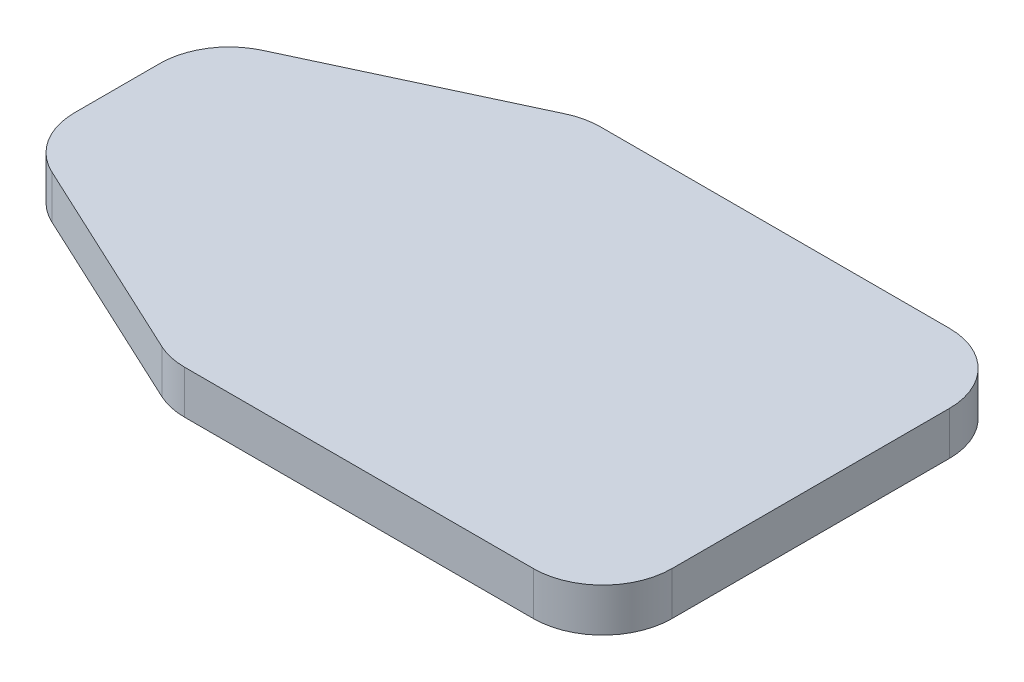
ISO-10303-21;
HEADER;
FILE_DESCRIPTION(('STEP AP214'),'2;1');
FILE_NAME('part.step','',(''),(''),'','','');
FILE_SCHEMA(('AUTOMOTIVE_DESIGN { 1 0 10303 214 1 1 1 1 }'));
ENDSEC;
DATA;
#1=APPLICATION_CONTEXT('core data for automotive mechanical design processes');
#2=APPLICATION_PROTOCOL_DEFINITION('international standard','automotive_design',2000,#1);
#3=PRODUCT_CONTEXT('',#1,'mechanical');
#4=PRODUCT('Part','Part','',(#3));
#5=PRODUCT_RELATED_PRODUCT_CATEGORY('part','',(#4));
#6=PRODUCT_DEFINITION_FORMATION('','',#4);
#7=PRODUCT_DEFINITION_CONTEXT('part definition',#1,'design');
#8=PRODUCT_DEFINITION('design','',#6,#7);
#9=PRODUCT_DEFINITION_SHAPE('','',#8);
#10=(LENGTH_UNIT() NAMED_UNIT(*) SI_UNIT(.MILLI.,.METRE.));
#11=(NAMED_UNIT(*) PLANE_ANGLE_UNIT() SI_UNIT($,.RADIAN.));
#12=(NAMED_UNIT(*) SI_UNIT($,.STERADIAN.) SOLID_ANGLE_UNIT());
#13=UNCERTAINTY_MEASURE_WITH_UNIT(LENGTH_MEASURE(1.E-05),#10,'distance_accuracy_value','');
#14=(GEOMETRIC_REPRESENTATION_CONTEXT(3) GLOBAL_UNCERTAINTY_ASSIGNED_CONTEXT((#13)) GLOBAL_UNIT_ASSIGNED_CONTEXT((#10,
#11,#12)) REPRESENTATION_CONTEXT('',''));
#15=CARTESIAN_POINT('',(0.,0.,0.));
#16=DIRECTION('',(0.,0.,1.));
#17=DIRECTION('',(1.,0.,0.));
#18=AXIS2_PLACEMENT_3D('',#15,#16,#17);
#19=CARTESIAN_POINT('',(-25.4,3.175,0.));
#20=DIRECTION('',(1.,0.,0.));
#21=DIRECTION('',(0.,0.,1.));
#22=AXIS2_PLACEMENT_3D('',#19,#20,#21);
#23=PLANE('',#22);
#24=DIRECTION('',(0.,0.,-1.));
#25=VECTOR('',#24,1.);
#26=CARTESIAN_POINT('',(-25.4,3.175,0.));
#27=LINE('',#26,#25);
#28=CARTESIAN_POINT('',(-25.4,3.175,3.11473583901241));
#29=VERTEX_POINT('',#28);
#30=CARTESIAN_POINT('',(-25.4,3.175,-3.1147358390124));
#31=VERTEX_POINT('',#30);
#32=EDGE_CURVE('E153',#29,#31,#27,.T.);
#33=ORIENTED_EDGE('',*,*,#32,.T.);
#34=DIRECTION('',(0.,-1.,0.));
#35=VECTOR('',#34,1.);
#36=CARTESIAN_POINT('',(-25.4,3.175,-3.1147358390124));
#37=LINE('',#36,#35);
#38=CARTESIAN_POINT('',(-25.4,0.,-3.1147358390124));
#39=VERTEX_POINT('',#38);
#40=EDGE_CURVE('E190',#39,#31,#37,.F.);
#41=ORIENTED_EDGE('',*,*,#40,.F.);
#42=DIRECTION('',(0.,0.,-1.));
#43=VECTOR('',#42,1.);
#44=CARTESIAN_POINT('',(-25.4,0.,0.));
#45=LINE('',#44,#43);
#46=CARTESIAN_POINT('',(-25.4,0.,3.11473583901241));
#47=VERTEX_POINT('',#46);
#48=EDGE_CURVE('E224',#47,#39,#45,.T.);
#49=ORIENTED_EDGE('',*,*,#48,.F.);
#50=DIRECTION('',(0.,-1.,0.));
#51=VECTOR('',#50,1.);
#52=CARTESIAN_POINT('',(-25.4,0.,3.11473583901241));
#53=LINE('',#52,#51);
#54=EDGE_CURVE('E139',#29,#47,#53,.T.);
#55=ORIENTED_EDGE('',*,*,#54,.F.);
#56=EDGE_LOOP('',(#33,#41,#49,#55));
#57=FACE_BOUND('',#56,.T.);
#58=ADVANCED_FACE('F41',(#57),#23,.F.);
#59=CARTESIAN_POINT('',(-6.9757299270073,3.175,-14.9479927007299));
#60=DIRECTION('',(0.422885465331124,0.,0.906183139995265));
#61=DIRECTION('',(-0.906183139995265,0.,0.422885465331124));
#62=AXIS2_PLACEMENT_3D('',#59,#60,#61);
#63=PLANE('',#62);
#64=DIRECTION('',(0.906183139995265,0.,-0.422885465331124));
#65=VECTOR('',#64,1.);
#66=CARTESIAN_POINT('',(-6.9757299270073,3.175,-14.9479927007299));
#67=LINE('',#66,#65);
#68=CARTESIAN_POINT('',(-22.4682581638821,3.175,-7.71814619018835));
#69=VERTEX_POINT('',#68);
#70=CARTESIAN_POINT('',(-7.37126353319441,3.175,-14.7634103511759));
#71=VERTEX_POINT('',#70);
#72=EDGE_CURVE('E212',#69,#71,#67,.T.);
#73=ORIENTED_EDGE('',*,*,#72,.T.);
#74=DIRECTION('',(0.,-1.,0.));
#75=VECTOR('',#74,1.);
#76=CARTESIAN_POINT('',(-7.37126353319441,3.175,-14.7634103511759));
#77=LINE('',#76,#75);
#78=CARTESIAN_POINT('',(-7.37126353319441,0.,-14.7634103511759));
#79=VERTEX_POINT('',#78);
#80=EDGE_CURVE('E49',#79,#71,#77,.F.);
#81=ORIENTED_EDGE('',*,*,#80,.F.);
#82=DIRECTION('',(0.906183139995265,0.,-0.422885465331124));
#83=VECTOR('',#82,1.);
#84=CARTESIAN_POINT('',(-6.9757299270073,0.,-14.9479927007299));
#85=LINE('',#84,#83);
#86=CARTESIAN_POINT('',(-22.4682581638821,0.,-7.71814619018835));
#87=VERTEX_POINT('',#86);
#88=EDGE_CURVE('E226',#87,#79,#85,.T.);
#89=ORIENTED_EDGE('',*,*,#88,.F.);
#90=DIRECTION('',(0.,-1.,0.));
#91=VECTOR('',#90,1.);
#92=CARTESIAN_POINT('',(-22.4682581638821,3.175,-7.71814619018835));
#93=LINE('',#92,#91);
#94=EDGE_CURVE('E11',#69,#87,#93,.T.);
#95=ORIENTED_EDGE('',*,*,#94,.F.);
#96=EDGE_LOOP('',(#73,#81,#89,#95));
#97=FACE_BOUND('',#96,.T.);
#98=ADVANCED_FACE('F213',(#97),#63,.F.);
#99=CARTESIAN_POINT('',(0.,3.175,-15.24));
#100=DIRECTION('',(0.,0.,1.));
#101=DIRECTION('',(-1.,0.,0.));
#102=AXIS2_PLACEMENT_3D('',#99,#100,#101);
#103=PLANE('',#102);
#104=DIRECTION('',(1.,0.,0.));
#105=VECTOR('',#104,1.);
#106=CARTESIAN_POINT('',(0.,0.,-15.24));
#107=LINE('',#106,#105);
#108=CARTESIAN_POINT('',(-5.2230053693123,0.,-15.24));
#109=VERTEX_POINT('',#108);
#110=CARTESIAN_POINT('',(20.32,0.,-15.24));
#111=VERTEX_POINT('',#110);
#112=EDGE_CURVE('E228',#109,#111,#107,.T.);
#113=ORIENTED_EDGE('',*,*,#112,.F.);
#114=DIRECTION('',(0.,-1.,0.));
#115=VECTOR('',#114,1.);
#116=CARTESIAN_POINT('',(-5.2230053693123,3.175,-15.24));
#117=LINE('',#116,#115);
#118=CARTESIAN_POINT('',(-5.2230053693123,3.175,-15.24));
#119=VERTEX_POINT('',#118);
#120=EDGE_CURVE('E198',#119,#109,#117,.T.);
#121=ORIENTED_EDGE('',*,*,#120,.F.);
#122=DIRECTION('',(1.,0.,0.));
#123=VECTOR('',#122,1.);
#124=CARTESIAN_POINT('',(0.,3.175,-15.24));
#125=LINE('',#124,#123);
#126=CARTESIAN_POINT('',(20.32,3.175,-15.24));
#127=VERTEX_POINT('',#126);
#128=EDGE_CURVE('E214',#119,#127,#125,.T.);
#129=ORIENTED_EDGE('',*,*,#128,.T.);
#130=DIRECTION('',(0.,-1.,0.));
#131=VECTOR('',#130,1.);
#132=CARTESIAN_POINT('',(20.32,3.175,-15.24));
#133=LINE('',#132,#131);
#134=EDGE_CURVE('E201',#111,#127,#133,.F.);
#135=ORIENTED_EDGE('',*,*,#134,.F.);
#136=EDGE_LOOP('',(#113,#121,#129,#135));
#137=FACE_BOUND('',#136,.T.);
#138=ADVANCED_FACE('F262',(#137),#103,.F.);
#139=CARTESIAN_POINT('',(25.4,3.175,0.));
#140=DIRECTION('',(1.,0.,0.));
#141=DIRECTION('',(0.,0.,1.));
#142=AXIS2_PLACEMENT_3D('',#139,#140,#141);
#143=PLANE('',#142);
#144=DIRECTION('',(0.,0.,-1.));
#145=VECTOR('',#144,1.);
#146=CARTESIAN_POINT('',(25.4,3.175,0.));
#147=LINE('',#146,#145);
#148=CARTESIAN_POINT('',(25.4,3.175,10.16));
#149=VERTEX_POINT('',#148);
#150=CARTESIAN_POINT('',(25.4,3.175,-10.16));
#151=VERTEX_POINT('',#150);
#152=EDGE_CURVE('E217',#149,#151,#147,.T.);
#153=ORIENTED_EDGE('',*,*,#152,.F.);
#154=DIRECTION('',(0.,-1.,0.));
#155=VECTOR('',#154,1.);
#156=CARTESIAN_POINT('',(25.4,3.175,10.16));
#157=LINE('',#156,#155);
#158=CARTESIAN_POINT('',(25.4,0.,10.16));
#159=VERTEX_POINT('',#158);
#160=EDGE_CURVE('E194',#159,#149,#157,.F.);
#161=ORIENTED_EDGE('',*,*,#160,.F.);
#162=DIRECTION('',(0.,0.,-1.));
#163=VECTOR('',#162,1.);
#164=CARTESIAN_POINT('',(25.4,0.,0.));
#165=LINE('',#164,#163);
#166=CARTESIAN_POINT('',(25.4,0.,-10.16));
#167=VERTEX_POINT('',#166);
#168=EDGE_CURVE('E231',#159,#167,#165,.T.);
#169=ORIENTED_EDGE('',*,*,#168,.T.);
#170=DIRECTION('',(0.,-1.,0.));
#171=VECTOR('',#170,1.);
#172=CARTESIAN_POINT('',(25.4,0.,-10.16));
#173=LINE('',#172,#171);
#174=EDGE_CURVE('E196',#151,#167,#173,.T.);
#175=ORIENTED_EDGE('',*,*,#174,.F.);
#176=EDGE_LOOP('',(#153,#161,#169,#175));
#177=FACE_BOUND('',#176,.T.);
#178=ADVANCED_FACE('F267',(#177),#143,.T.);
#179=CARTESIAN_POINT('',(0.,3.175,15.24));
#180=DIRECTION('',(0.,0.,1.));
#181=DIRECTION('',(-1.,0.,0.));
#182=AXIS2_PLACEMENT_3D('',#179,#180,#181);
#183=PLANE('',#182);
#184=DIRECTION('',(1.,0.,0.));
#185=VECTOR('',#184,1.);
#186=CARTESIAN_POINT('',(0.,0.,15.24));
#187=LINE('',#186,#185);
#188=CARTESIAN_POINT('',(-5.2230053693123,0.,15.24));
#189=VERTEX_POINT('',#188);
#190=CARTESIAN_POINT('',(20.32,0.,15.24));
#191=VERTEX_POINT('',#190);
#192=EDGE_CURVE('E154',#189,#191,#187,.T.);
#193=ORIENTED_EDGE('',*,*,#192,.T.);
#194=DIRECTION('',(0.,-1.,0.));
#195=VECTOR('',#194,1.);
#196=CARTESIAN_POINT('',(20.32,3.175,15.24));
#197=LINE('',#196,#195);
#198=CARTESIAN_POINT('',(20.32,3.175,15.24));
#199=VERTEX_POINT('',#198);
#200=EDGE_CURVE('E174',#199,#191,#197,.T.);
#201=ORIENTED_EDGE('',*,*,#200,.F.);
#202=DIRECTION('',(1.,0.,0.));
#203=VECTOR('',#202,1.);
#204=CARTESIAN_POINT('',(0.,3.175,15.24));
#205=LINE('',#204,#203);
#206=CARTESIAN_POINT('',(-5.2230053693123,3.175,15.24));
#207=VERTEX_POINT('',#206);
#208=EDGE_CURVE('E163',#207,#199,#205,.T.);
#209=ORIENTED_EDGE('',*,*,#208,.F.);
#210=DIRECTION('',(0.,-1.,0.));
#211=VECTOR('',#210,1.);
#212=CARTESIAN_POINT('',(-5.2230053693123,3.175,15.24));
#213=LINE('',#212,#211);
#214=EDGE_CURVE('E177',#189,#207,#213,.F.);
#215=ORIENTED_EDGE('',*,*,#214,.F.);
#216=EDGE_LOOP('',(#193,#201,#209,#215));
#217=FACE_BOUND('',#216,.T.);
#218=ADVANCED_FACE('F237',(#217),#183,.T.);
#219=CARTESIAN_POINT('',(-6.9757299270073,3.175,14.9479927007299));
#220=DIRECTION('',(-0.422885465331124,0.,0.906183139995265));
#221=DIRECTION('',(-0.906183139995265,0.,-0.422885465331124));
#222=AXIS2_PLACEMENT_3D('',#219,#220,#221);
#223=PLANE('',#222);
#224=DIRECTION('',(0.906183139995265,0.,0.422885465331124));
#225=VECTOR('',#224,1.);
#226=CARTESIAN_POINT('',(-6.9757299270073,3.175,14.9479927007299));
#227=LINE('',#226,#225);
#228=CARTESIAN_POINT('',(-22.4682581638821,3.175,7.71814619018835));
#229=VERTEX_POINT('',#228);
#230=CARTESIAN_POINT('',(-7.37126353319441,3.175,14.7634103511759));
#231=VERTEX_POINT('',#230);
#232=EDGE_CURVE('E158',#229,#231,#227,.T.);
#233=ORIENTED_EDGE('',*,*,#232,.F.);
#234=DIRECTION('',(0.,-1.,0.));
#235=VECTOR('',#234,1.);
#236=CARTESIAN_POINT('',(-22.4682581638821,3.175,7.71814619018835));
#237=LINE('',#236,#235);
#238=CARTESIAN_POINT('',(-22.4682581638821,0.,7.71814619018835));
#239=VERTEX_POINT('',#238);
#240=EDGE_CURVE('E136',#239,#229,#237,.F.);
#241=ORIENTED_EDGE('',*,*,#240,.F.);
#242=DIRECTION('',(0.906183139995265,0.,0.422885465331124));
#243=VECTOR('',#242,1.);
#244=CARTESIAN_POINT('',(-6.9757299270073,0.,14.9479927007299));
#245=LINE('',#244,#243);
#246=CARTESIAN_POINT('',(-7.37126353319441,0.,14.7634103511759));
#247=VERTEX_POINT('',#246);
#248=EDGE_CURVE('E147',#239,#247,#245,.T.);
#249=ORIENTED_EDGE('',*,*,#248,.T.);
#250=DIRECTION('',(0.,-1.,0.));
#251=VECTOR('',#250,1.);
#252=CARTESIAN_POINT('',(-7.37126353319441,3.175,14.7634103511759));
#253=LINE('',#252,#251);
#254=EDGE_CURVE('E159',#231,#247,#253,.T.);
#255=ORIENTED_EDGE('',*,*,#254,.F.);
#256=EDGE_LOOP('',(#233,#241,#249,#255));
#257=FACE_BOUND('',#256,.T.);
#258=ADVANCED_FACE('F156',(#257),#223,.T.);
#259=CARTESIAN_POINT('',(0.,3.175,0.));
#260=DIRECTION('',(0.,1.,0.));
#261=DIRECTION('',(0.,0.,-1.));
#262=AXIS2_PLACEMENT_3D('',#259,#260,#261);
#263=PLANE('',#262);
#264=ORIENTED_EDGE('',*,*,#208,.T.);
#265=CARTESIAN_POINT('',(20.32,3.175,10.16));
#266=DIRECTION('',(0.,-1.,0.));
#267=DIRECTION('',(0.,0.,-1.));
#268=AXIS2_PLACEMENT_3D('',#265,#266,#267);
#269=CIRCLE('',#268,5.08);
#270=EDGE_CURVE('E64',#149,#199,#269,.T.);
#271=ORIENTED_EDGE('',*,*,#270,.F.);
#272=ORIENTED_EDGE('',*,*,#152,.T.);
#273=CARTESIAN_POINT('',(20.32,3.175,-10.16));
#274=DIRECTION('',(0.,-1.,0.));
#275=DIRECTION('',(0.,0.,-1.));
#276=AXIS2_PLACEMENT_3D('',#273,#274,#275);
#277=CIRCLE('',#276,5.08);
#278=EDGE_CURVE('E56',#127,#151,#277,.T.);
#279=ORIENTED_EDGE('',*,*,#278,.F.);
#280=ORIENTED_EDGE('',*,*,#128,.F.);
#281=CARTESIAN_POINT('',(-5.2230053693123,3.175,-10.16));
#282=DIRECTION('',(0.,-1.,0.));
#283=DIRECTION('',(0.,0.,-1.));
#284=AXIS2_PLACEMENT_3D('',#281,#282,#283);
#285=CIRCLE('',#284,5.08);
#286=EDGE_CURVE('E180',#71,#119,#285,.T.);
#287=ORIENTED_EDGE('',*,*,#286,.F.);
#288=ORIENTED_EDGE('',*,*,#72,.F.);
#289=CARTESIAN_POINT('',(-20.32,3.175,-3.1147358390124));
#290=DIRECTION('',(0.,-1.,0.));
#291=DIRECTION('',(0.,0.,-1.));
#292=AXIS2_PLACEMENT_3D('',#289,#290,#291);
#293=CIRCLE('',#292,5.08);
#294=EDGE_CURVE('E182',#31,#69,#293,.T.);
#295=ORIENTED_EDGE('',*,*,#294,.F.);
#296=ORIENTED_EDGE('',*,*,#32,.F.);
#297=CARTESIAN_POINT('',(-20.32,3.175,3.11473583901241));
#298=DIRECTION('',(0.,-1.,0.));
#299=DIRECTION('',(0.,0.,-1.));
#300=AXIS2_PLACEMENT_3D('',#297,#298,#299);
#301=CIRCLE('',#300,5.08);
#302=EDGE_CURVE('E186',#229,#29,#301,.T.);
#303=ORIENTED_EDGE('',*,*,#302,.F.);
#304=ORIENTED_EDGE('',*,*,#232,.T.);
#305=CARTESIAN_POINT('',(-5.2230053693123,3.175,10.16));
#306=DIRECTION('',(0.,-1.,0.));
#307=DIRECTION('',(0.,0.,-1.));
#308=AXIS2_PLACEMENT_3D('',#305,#306,#307);
#309=CIRCLE('',#308,5.08);
#310=EDGE_CURVE('E188',#207,#231,#309,.T.);
#311=ORIENTED_EDGE('',*,*,#310,.F.);
#312=EDGE_LOOP('',(#264,#271,#272,#279,#280,#287,#288,#295,#296,#303,#304,#311));
#313=FACE_BOUND('',#312,.T.);
#314=ADVANCED_FACE('F244',(#313),#263,.T.);
#315=CARTESIAN_POINT('',(0.,0.,0.));
#316=DIRECTION('',(0.,1.,0.));
#317=DIRECTION('',(0.,0.,-1.));
#318=AXIS2_PLACEMENT_3D('',#315,#316,#317);
#319=PLANE('',#318);
#320=ORIENTED_EDGE('',*,*,#248,.F.);
#321=CARTESIAN_POINT('',(-20.32,0.,3.11473583901241));
#322=DIRECTION('',(0.,-1.,0.));
#323=DIRECTION('',(0.,0.,-1.));
#324=AXIS2_PLACEMENT_3D('',#321,#322,#323);
#325=CIRCLE('',#324,5.08);
#326=EDGE_CURVE('E132',#47,#239,#325,.F.);
#327=ORIENTED_EDGE('',*,*,#326,.F.);
#328=ORIENTED_EDGE('',*,*,#48,.T.);
#329=CARTESIAN_POINT('',(-20.32,0.,-3.1147358390124));
#330=DIRECTION('',(0.,-1.,0.));
#331=DIRECTION('',(0.,0.,-1.));
#332=AXIS2_PLACEMENT_3D('',#329,#330,#331);
#333=CIRCLE('',#332,5.08);
#334=EDGE_CURVE('E168',#87,#39,#333,.F.);
#335=ORIENTED_EDGE('',*,*,#334,.F.);
#336=ORIENTED_EDGE('',*,*,#88,.T.);
#337=CARTESIAN_POINT('',(-5.2230053693123,0.,-10.16));
#338=DIRECTION('',(0.,-1.,0.));
#339=DIRECTION('',(0.,0.,-1.));
#340=AXIS2_PLACEMENT_3D('',#337,#338,#339);
#341=CIRCLE('',#340,5.08);
#342=EDGE_CURVE('E161',#109,#79,#341,.F.);
#343=ORIENTED_EDGE('',*,*,#342,.F.);
#344=ORIENTED_EDGE('',*,*,#112,.T.);
#345=CARTESIAN_POINT('',(20.32,0.,-10.16));
#346=DIRECTION('',(0.,-1.,0.));
#347=DIRECTION('',(0.,0.,-1.));
#348=AXIS2_PLACEMENT_3D('',#345,#346,#347);
#349=CIRCLE('',#348,5.08);
#350=EDGE_CURVE('E144',#167,#111,#349,.F.);
#351=ORIENTED_EDGE('',*,*,#350,.F.);
#352=ORIENTED_EDGE('',*,*,#168,.F.);
#353=CARTESIAN_POINT('',(20.32,0.,10.16));
#354=DIRECTION('',(0.,-1.,0.));
#355=DIRECTION('',(0.,0.,-1.));
#356=AXIS2_PLACEMENT_3D('',#353,#354,#355);
#357=CIRCLE('',#356,5.08);
#358=EDGE_CURVE('E170',#191,#159,#357,.F.);
#359=ORIENTED_EDGE('',*,*,#358,.F.);
#360=ORIENTED_EDGE('',*,*,#192,.F.);
#361=CARTESIAN_POINT('',(-5.2230053693123,0.,10.16));
#362=DIRECTION('',(0.,-1.,0.));
#363=DIRECTION('',(0.,0.,-1.));
#364=AXIS2_PLACEMENT_3D('',#361,#362,#363);
#365=CIRCLE('',#364,5.08);
#366=EDGE_CURVE('E143',#247,#189,#365,.F.);
#367=ORIENTED_EDGE('',*,*,#366,.F.);
#368=EDGE_LOOP('',(#320,#327,#328,#335,#336,#343,#344,#351,#352,#359,#360,#367));
#369=FACE_BOUND('',#368,.T.);
#370=ADVANCED_FACE('F148',(#369),#319,.F.);
#371=CARTESIAN_POINT('',(-5.2230053693123,3.175,10.16));
#372=DIRECTION('',(0.,-1.,0.));
#373=DIRECTION('',(0.,0.,1.));
#374=AXIS2_PLACEMENT_3D('',#371,#372,#373);
#375=CYLINDRICAL_SURFACE('',#374,5.08);
#376=ORIENTED_EDGE('',*,*,#310,.T.);
#377=ORIENTED_EDGE('',*,*,#254,.T.);
#378=ORIENTED_EDGE('',*,*,#366,.T.);
#379=ORIENTED_EDGE('',*,*,#214,.T.);
#380=EDGE_LOOP('',(#376,#377,#378,#379));
#381=FACE_BOUND('',#380,.T.);
#382=ADVANCED_FACE('F246',(#381),#375,.T.);
#383=CARTESIAN_POINT('',(-20.32,3.175,3.11473583901241));
#384=DIRECTION('',(0.,1.,0.));
#385=DIRECTION('',(0.,0.,-1.));
#386=AXIS2_PLACEMENT_3D('',#383,#384,#385);
#387=CYLINDRICAL_SURFACE('',#386,5.08);
#388=ORIENTED_EDGE('',*,*,#302,.T.);
#389=ORIENTED_EDGE('',*,*,#54,.T.);
#390=ORIENTED_EDGE('',*,*,#326,.T.);
#391=ORIENTED_EDGE('',*,*,#240,.T.);
#392=EDGE_LOOP('',(#388,#389,#390,#391));
#393=FACE_BOUND('',#392,.T.);
#394=ADVANCED_FACE('F134',(#393),#387,.T.);
#395=CARTESIAN_POINT('',(20.32,3.175,-10.16));
#396=DIRECTION('',(0.,1.,0.));
#397=DIRECTION('',(0.,0.,-1.));
#398=AXIS2_PLACEMENT_3D('',#395,#396,#397);
#399=CYLINDRICAL_SURFACE('',#398,5.08);
#400=ORIENTED_EDGE('',*,*,#278,.T.);
#401=ORIENTED_EDGE('',*,*,#174,.T.);
#402=ORIENTED_EDGE('',*,*,#350,.T.);
#403=ORIENTED_EDGE('',*,*,#134,.T.);
#404=EDGE_LOOP('',(#400,#401,#402,#403));
#405=FACE_BOUND('',#404,.T.);
#406=ADVANCED_FACE('F253',(#405),#399,.T.);
#407=CARTESIAN_POINT('',(20.32,3.175,10.16));
#408=DIRECTION('',(0.,-1.,0.));
#409=DIRECTION('',(0.,0.,1.));
#410=AXIS2_PLACEMENT_3D('',#407,#408,#409);
#411=CYLINDRICAL_SURFACE('',#410,5.08);
#412=ORIENTED_EDGE('',*,*,#270,.T.);
#413=ORIENTED_EDGE('',*,*,#200,.T.);
#414=ORIENTED_EDGE('',*,*,#358,.T.);
#415=ORIENTED_EDGE('',*,*,#160,.T.);
#416=EDGE_LOOP('',(#412,#413,#414,#415));
#417=FACE_BOUND('',#416,.T.);
#418=ADVANCED_FACE('F242',(#417),#411,.T.);
#419=CARTESIAN_POINT('',(-20.32,3.175,-3.1147358390124));
#420=DIRECTION('',(0.,-1.,0.));
#421=DIRECTION('',(0.,0.,1.));
#422=AXIS2_PLACEMENT_3D('',#419,#420,#421);
#423=CYLINDRICAL_SURFACE('',#422,5.08);
#424=ORIENTED_EDGE('',*,*,#294,.T.);
#425=ORIENTED_EDGE('',*,*,#94,.T.);
#426=ORIENTED_EDGE('',*,*,#334,.T.);
#427=ORIENTED_EDGE('',*,*,#40,.T.);
#428=EDGE_LOOP('',(#424,#425,#426,#427));
#429=FACE_BOUND('',#428,.T.);
#430=ADVANCED_FACE('F316',(#429),#423,.T.);
#431=CARTESIAN_POINT('',(-5.2230053693123,3.175,-10.16));
#432=DIRECTION('',(0.,-1.,0.));
#433=DIRECTION('',(0.,0.,1.));
#434=AXIS2_PLACEMENT_3D('',#431,#432,#433);
#435=CYLINDRICAL_SURFACE('',#434,5.08);
#436=ORIENTED_EDGE('',*,*,#286,.T.);
#437=ORIENTED_EDGE('',*,*,#120,.T.);
#438=ORIENTED_EDGE('',*,*,#342,.T.);
#439=ORIENTED_EDGE('',*,*,#80,.T.);
#440=EDGE_LOOP('',(#436,#437,#438,#439));
#441=FACE_BOUND('',#440,.T.);
#442=ADVANCED_FACE('F43',(#441),#435,.T.);
#443=CLOSED_SHELL('',(#58,#98,#138,#178,#218,#258,#314,#370,#382,#394,#406,#418,#430,#442));
#444=MANIFOLD_SOLID_BREP('B2',#443);
#445=ADVANCED_BREP_SHAPE_REPRESENTATION('',(#18,#444),#14);
#446=SHAPE_DEFINITION_REPRESENTATION(#9,#445);
ENDSEC;
END-ISO-10303-21;
